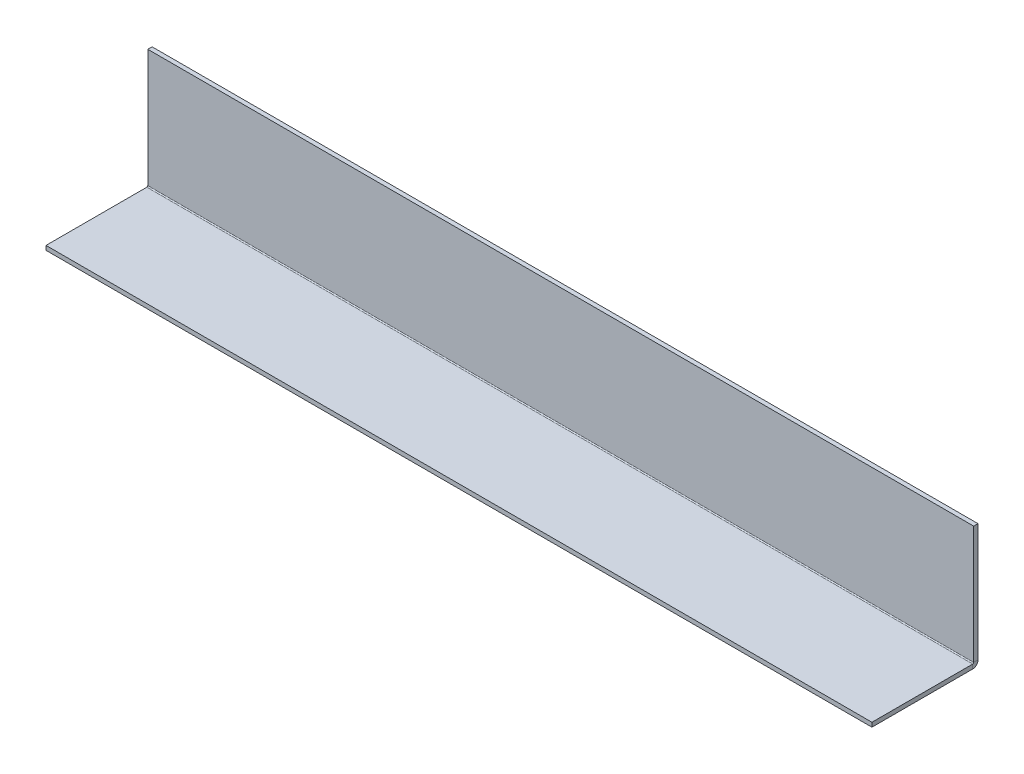
ISO-10303-21;
HEADER;
FILE_DESCRIPTION(('STEP AP214'),'2;1');
FILE_NAME('part.step','',(''),(''),'','','');
FILE_SCHEMA(('AUTOMOTIVE_DESIGN { 1 0 10303 214 1 1 1 1 }'));
ENDSEC;
DATA;
#1=APPLICATION_CONTEXT('core data for automotive mechanical design processes');
#2=APPLICATION_PROTOCOL_DEFINITION('international standard','automotive_design',2000,#1);
#3=PRODUCT_CONTEXT('',#1,'mechanical');
#4=PRODUCT('Part','Part','',(#3));
#5=PRODUCT_RELATED_PRODUCT_CATEGORY('part','',(#4));
#6=PRODUCT_DEFINITION_FORMATION('','',#4);
#7=PRODUCT_DEFINITION_CONTEXT('part definition',#1,'design');
#8=PRODUCT_DEFINITION('design','',#6,#7);
#9=PRODUCT_DEFINITION_SHAPE('','',#8);
#10=(LENGTH_UNIT() NAMED_UNIT(*) SI_UNIT(.MILLI.,.METRE.));
#11=(NAMED_UNIT(*) PLANE_ANGLE_UNIT() SI_UNIT($,.RADIAN.));
#12=(NAMED_UNIT(*) SI_UNIT($,.STERADIAN.) SOLID_ANGLE_UNIT());
#13=UNCERTAINTY_MEASURE_WITH_UNIT(LENGTH_MEASURE(1.E-05),#10,'distance_accuracy_value','');
#14=(GEOMETRIC_REPRESENTATION_CONTEXT(3) GLOBAL_UNCERTAINTY_ASSIGNED_CONTEXT((#13)) GLOBAL_UNIT_ASSIGNED_CONTEXT((#10,
#11,#12)) REPRESENTATION_CONTEXT('',''));
#15=CARTESIAN_POINT('',(0.,0.,0.));
#16=DIRECTION('',(0.,0.,1.));
#17=DIRECTION('',(1.,0.,0.));
#18=AXIS2_PLACEMENT_3D('',#15,#16,#17);
#19=CARTESIAN_POINT('',(304.8,-11.6112561284477,75.111256128448));
#20=DIRECTION('',(1.,0.,0.));
#21=DIRECTION('',(0.,-1.,0.));
#22=AXIS2_PLACEMENT_3D('',#19,#20,#21);
#23=PLANE('',#22);
#24=DIRECTION('',(0.,0.,-1.));
#25=VECTOR('',#24,1.);
#26=CARTESIAN_POINT('',(304.8,-11.6112561284477,75.111256128448));
#27=LINE('',#26,#25);
#28=CARTESIAN_POINT('',(304.8,-11.6112561284477,75.111256128448));
#29=VERTEX_POINT('',#28);
#30=CARTESIAN_POINT('',(304.8,-11.611256128448,0.736600000000014));
#31=VERTEX_POINT('',#30);
#32=EDGE_CURVE('E152',#29,#31,#27,.T.);
#33=ORIENTED_EDGE('',*,*,#32,.T.);
#34=DIRECTION('',(0.,1.,0.));
#35=VECTOR('',#34,1.);
#36=CARTESIAN_POINT('',(304.8,-11.6112561284474,0.7366));
#37=LINE('',#36,#35);
#38=CARTESIAN_POINT('',(304.8,-8.43625612844795,0.736600000000005));
#39=VERTEX_POINT('',#38);
#40=EDGE_CURVE('E48',#31,#39,#37,.T.);
#41=ORIENTED_EDGE('',*,*,#40,.T.);
#42=DIRECTION('',(0.,0.,-1.));
#43=VECTOR('',#42,1.);
#44=CARTESIAN_POINT('',(304.8,-8.43625612844771,75.111256128448));
#45=LINE('',#44,#43);
#46=CARTESIAN_POINT('',(304.8,-8.43625612844771,75.111256128448));
#47=VERTEX_POINT('',#46);
#48=EDGE_CURVE('E121',#47,#39,#45,.T.);
#49=ORIENTED_EDGE('',*,*,#48,.F.);
#50=DIRECTION('',(0.,1.,0.));
#51=VECTOR('',#50,1.);
#52=CARTESIAN_POINT('',(304.8,-11.6112561284477,75.111256128448));
#53=LINE('',#52,#51);
#54=EDGE_CURVE('E153',#29,#47,#53,.T.);
#55=ORIENTED_EDGE('',*,*,#54,.F.);
#56=EDGE_LOOP('',(#33,#41,#49,#55));
#57=FACE_BOUND('',#56,.T.);
#58=ADVANCED_FACE('F41',(#57),#23,.T.);
#59=CARTESIAN_POINT('',(-304.8,-11.6112561284477,75.111256128448));
#60=DIRECTION('',(-1.,0.,0.));
#61=DIRECTION('',(0.,1.,0.));
#62=AXIS2_PLACEMENT_3D('',#59,#60,#61);
#63=PLANE('',#62);
#64=DIRECTION('',(0.,0.,1.));
#65=VECTOR('',#64,1.);
#66=CARTESIAN_POINT('',(-304.8,-8.43625612844771,75.111256128448));
#67=LINE('',#66,#65);
#68=CARTESIAN_POINT('',(-304.8,-8.43625612844795,0.736600000000005));
#69=VERTEX_POINT('',#68);
#70=CARTESIAN_POINT('',(-304.8,-8.43625612844771,75.111256128448));
#71=VERTEX_POINT('',#70);
#72=EDGE_CURVE('E125',#69,#71,#67,.T.);
#73=ORIENTED_EDGE('',*,*,#72,.F.);
#74=DIRECTION('',(0.,-1.,0.));
#75=VECTOR('',#74,1.);
#76=CARTESIAN_POINT('',(-304.8,-11.6112561284474,0.7366));
#77=LINE('',#76,#75);
#78=CARTESIAN_POINT('',(-304.8,-11.611256128448,0.736600000000029));
#79=VERTEX_POINT('',#78);
#80=EDGE_CURVE('E160',#69,#79,#77,.T.);
#81=ORIENTED_EDGE('',*,*,#80,.T.);
#82=DIRECTION('',(0.,0.,1.));
#83=VECTOR('',#82,1.);
#84=CARTESIAN_POINT('',(-304.8,-11.6112561284477,75.111256128448));
#85=LINE('',#84,#83);
#86=CARTESIAN_POINT('',(-304.8,-11.6112561284477,75.111256128448));
#87=VERTEX_POINT('',#86);
#88=EDGE_CURVE('E148',#79,#87,#85,.T.);
#89=ORIENTED_EDGE('',*,*,#88,.T.);
#90=DIRECTION('',(0.,1.,0.));
#91=VECTOR('',#90,1.);
#92=CARTESIAN_POINT('',(-304.8,-11.6112561284477,75.111256128448));
#93=LINE('',#92,#91);
#94=EDGE_CURVE('E147',#87,#71,#93,.T.);
#95=ORIENTED_EDGE('',*,*,#94,.T.);
#96=EDGE_LOOP('',(#73,#81,#89,#95));
#97=FACE_BOUND('',#96,.T.);
#98=ADVANCED_FACE('F173',(#97),#63,.T.);
#99=CARTESIAN_POINT('',(0.,-11.611256128448,-10.613743871552));
#100=DIRECTION('',(0.,-1.,0.));
#101=DIRECTION('',(-1.,0.,0.));
#102=AXIS2_PLACEMENT_3D('',#99,#100,#101);
#103=PLANE('',#102);
#104=ORIENTED_EDGE('',*,*,#88,.F.);
#105=DIRECTION('',(1.,0.,0.));
#106=VECTOR('',#105,1.);
#107=CARTESIAN_POINT('',(0.,-11.611256128448,0.7366));
#108=LINE('',#107,#106);
#109=EDGE_CURVE('E155',#79,#31,#108,.T.);
#110=ORIENTED_EDGE('',*,*,#109,.T.);
#111=ORIENTED_EDGE('',*,*,#32,.F.);
#112=DIRECTION('',(1.,0.,0.));
#113=VECTOR('',#112,1.);
#114=CARTESIAN_POINT('',(-304.8,-11.6112561284477,75.111256128448));
#115=LINE('',#114,#113);
#116=EDGE_CURVE('E144',#87,#29,#115,.T.);
#117=ORIENTED_EDGE('',*,*,#116,.F.);
#118=EDGE_LOOP('',(#104,#110,#111,#117));
#119=FACE_BOUND('',#118,.T.);
#120=ADVANCED_FACE('F180',(#119),#103,.T.);
#121=CARTESIAN_POINT('',(-304.8,-11.6112561284477,75.111256128448));
#122=DIRECTION('',(0.,0.,1.));
#123=DIRECTION('',(0.,-1.,0.));
#124=AXIS2_PLACEMENT_3D('',#121,#122,#123);
#125=PLANE('',#124);
#126=DIRECTION('',(1.,0.,0.));
#127=VECTOR('',#126,1.);
#128=CARTESIAN_POINT('',(-304.8,-8.43625612844771,75.111256128448));
#129=LINE('',#128,#127);
#130=EDGE_CURVE('E149',#71,#47,#129,.T.);
#131=ORIENTED_EDGE('',*,*,#130,.F.);
#132=ORIENTED_EDGE('',*,*,#94,.F.);
#133=ORIENTED_EDGE('',*,*,#116,.T.);
#134=ORIENTED_EDGE('',*,*,#54,.T.);
#135=EDGE_LOOP('',(#131,#132,#133,#134));
#136=FACE_BOUND('',#135,.T.);
#137=ADVANCED_FACE('F178',(#136),#125,.T.);
#138=CARTESIAN_POINT('',(0.,-8.43625612844801,-10.613743871552));
#139=DIRECTION('',(0.,-1.,0.));
#140=DIRECTION('',(-1.,0.,0.));
#141=AXIS2_PLACEMENT_3D('',#138,#139,#140);
#142=PLANE('',#141);
#143=DIRECTION('',(1.,0.,0.));
#144=VECTOR('',#143,1.);
#145=CARTESIAN_POINT('',(0.,-8.43625612844797,0.736600000000013));
#146=LINE('',#145,#144);
#147=EDGE_CURVE('E163',#69,#39,#146,.T.);
#148=ORIENTED_EDGE('',*,*,#147,.F.);
#149=ORIENTED_EDGE('',*,*,#72,.T.);
#150=ORIENTED_EDGE('',*,*,#130,.T.);
#151=ORIENTED_EDGE('',*,*,#48,.T.);
#152=EDGE_LOOP('',(#148,#149,#150,#151));
#153=FACE_BOUND('',#152,.T.);
#154=ADVANCED_FACE('F185',(#153),#142,.F.);
#155=CARTESIAN_POINT('',(0.,0.,-3.175));
#156=DIRECTION('',(0.,0.,-1.));
#157=DIRECTION('',(-1.,0.,0.));
#158=AXIS2_PLACEMENT_3D('',#155,#156,#157);
#159=PLANE('',#158);
#160=DIRECTION('',(-1.,0.,0.));
#161=VECTOR('',#160,1.);
#162=CARTESIAN_POINT('',(304.8,79.375,-3.175));
#163=LINE('',#162,#161);
#164=CARTESIAN_POINT('',(304.8,79.375,-3.175));
#165=VERTEX_POINT('',#164);
#166=CARTESIAN_POINT('',(-304.8,79.375,-3.175));
#167=VERTEX_POINT('',#166);
#168=EDGE_CURVE('E104',#165,#167,#163,.T.);
#169=ORIENTED_EDGE('',*,*,#168,.F.);
#170=DIRECTION('',(0.,1.,0.));
#171=VECTOR('',#170,1.);
#172=CARTESIAN_POINT('',(304.8,-85.725,-3.175));
#173=LINE('',#172,#171);
#174=CARTESIAN_POINT('',(304.8,-7.69965612844796,-3.175));
#175=VERTEX_POINT('',#174);
#176=EDGE_CURVE('E113',#175,#165,#173,.T.);
#177=ORIENTED_EDGE('',*,*,#176,.F.);
#178=DIRECTION('',(1.,0.,0.));
#179=VECTOR('',#178,1.);
#180=CARTESIAN_POINT('',(0.,-7.69965612844796,-3.175));
#181=LINE('',#180,#179);
#182=CARTESIAN_POINT('',(-304.8,-7.69965612844796,-3.175));
#183=VERTEX_POINT('',#182);
#184=EDGE_CURVE('E142',#183,#175,#181,.T.);
#185=ORIENTED_EDGE('',*,*,#184,.F.);
#186=DIRECTION('',(0.,-1.,0.));
#187=VECTOR('',#186,1.);
#188=CARTESIAN_POINT('',(-304.8,-85.725,-3.175));
#189=LINE('',#188,#187);
#190=EDGE_CURVE('E115',#167,#183,#189,.T.);
#191=ORIENTED_EDGE('',*,*,#190,.F.);
#192=EDGE_LOOP('',(#169,#177,#185,#191));
#193=FACE_BOUND('',#192,.T.);
#194=ADVANCED_FACE('F111',(#193),#159,.T.);
#195=CARTESIAN_POINT('',(-304.8,-85.725,-3.175));
#196=DIRECTION('',(-1.,0.,0.));
#197=DIRECTION('',(0.,0.,1.));
#198=AXIS2_PLACEMENT_3D('',#195,#196,#197);
#199=PLANE('',#198);
#200=DIRECTION('',(0.,0.,-1.));
#201=VECTOR('',#200,1.);
#202=CARTESIAN_POINT('',(-304.8,79.375,75.111256128448));
#203=LINE('',#202,#201);
#204=CARTESIAN_POINT('',(-304.8,79.375,0.));
#205=VERTEX_POINT('',#204);
#206=EDGE_CURVE('E116',#205,#167,#203,.T.);
#207=ORIENTED_EDGE('',*,*,#206,.T.);
#208=ORIENTED_EDGE('',*,*,#190,.T.);
#209=DIRECTION('',(0.,0.,-1.));
#210=VECTOR('',#209,1.);
#211=CARTESIAN_POINT('',(-304.8,-7.69965612844795,-3.17499999999946));
#212=LINE('',#211,#210);
#213=CARTESIAN_POINT('',(-304.8,-7.69965612844797,0.));
#214=VERTEX_POINT('',#213);
#215=EDGE_CURVE('E138',#214,#183,#212,.T.);
#216=ORIENTED_EDGE('',*,*,#215,.F.);
#217=DIRECTION('',(0.,-1.,0.));
#218=VECTOR('',#217,1.);
#219=CARTESIAN_POINT('',(-304.8,-85.725,0.));
#220=LINE('',#219,#218);
#221=EDGE_CURVE('E135',#205,#214,#220,.T.);
#222=ORIENTED_EDGE('',*,*,#221,.F.);
#223=EDGE_LOOP('',(#207,#208,#216,#222));
#224=FACE_BOUND('',#223,.T.);
#225=ADVANCED_FACE('F205',(#224),#199,.T.);
#226=CARTESIAN_POINT('',(0.,0.,0.));
#227=DIRECTION('',(0.,0.,-1.));
#228=DIRECTION('',(-1.,0.,0.));
#229=AXIS2_PLACEMENT_3D('',#226,#227,#228);
#230=PLANE('',#229);
#231=DIRECTION('',(0.,1.,0.));
#232=VECTOR('',#231,1.);
#233=CARTESIAN_POINT('',(304.8,-85.725,0.));
#234=LINE('',#233,#232);
#235=CARTESIAN_POINT('',(304.8,-7.69965612844797,0.));
#236=VERTEX_POINT('',#235);
#237=CARTESIAN_POINT('',(304.8,79.375,0.));
#238=VERTEX_POINT('',#237);
#239=EDGE_CURVE('E122',#236,#238,#234,.T.);
#240=ORIENTED_EDGE('',*,*,#239,.T.);
#241=DIRECTION('',(-1.,0.,0.));
#242=VECTOR('',#241,1.);
#243=CARTESIAN_POINT('',(0.,79.375,0.));
#244=LINE('',#243,#242);
#245=EDGE_CURVE('E54',#238,#205,#244,.T.);
#246=ORIENTED_EDGE('',*,*,#245,.T.);
#247=ORIENTED_EDGE('',*,*,#221,.T.);
#248=DIRECTION('',(1.,0.,0.));
#249=VECTOR('',#248,1.);
#250=CARTESIAN_POINT('',(0.,-7.69965612844798,0.));
#251=LINE('',#250,#249);
#252=EDGE_CURVE('E127',#214,#236,#251,.T.);
#253=ORIENTED_EDGE('',*,*,#252,.T.);
#254=EDGE_LOOP('',(#240,#246,#247,#253));
#255=FACE_BOUND('',#254,.T.);
#256=ADVANCED_FACE('F208',(#255),#230,.F.);
#257=CARTESIAN_POINT('',(304.8,-85.725,-3.175));
#258=DIRECTION('',(1.,0.,0.));
#259=DIRECTION('',(0.,0.,-1.));
#260=AXIS2_PLACEMENT_3D('',#257,#258,#259);
#261=PLANE('',#260);
#262=DIRECTION('',(0.,0.,-1.));
#263=VECTOR('',#262,1.);
#264=CARTESIAN_POINT('',(304.8,79.375,-3.175));
#265=LINE('',#264,#263);
#266=EDGE_CURVE('E12',#238,#165,#265,.T.);
#267=ORIENTED_EDGE('',*,*,#266,.F.);
#268=ORIENTED_EDGE('',*,*,#239,.F.);
#269=DIRECTION('',(0.,0.,1.));
#270=VECTOR('',#269,1.);
#271=CARTESIAN_POINT('',(304.8,-7.69965612844795,-3.17499999999946));
#272=LINE('',#271,#270);
#273=EDGE_CURVE('E120',#175,#236,#272,.T.);
#274=ORIENTED_EDGE('',*,*,#273,.F.);
#275=ORIENTED_EDGE('',*,*,#176,.T.);
#276=EDGE_LOOP('',(#267,#268,#274,#275));
#277=FACE_BOUND('',#276,.T.);
#278=ADVANCED_FACE('F118',(#277),#261,.T.);
#279=CARTESIAN_POINT('',(-304.8,-7.69965612844796,0.7366));
#280=DIRECTION('',(-1.,0.,0.));
#281=DIRECTION('',(0.,0.,1.));
#282=AXIS2_PLACEMENT_3D('',#279,#280,#281);
#283=PLANE('',#282);
#284=ORIENTED_EDGE('',*,*,#80,.F.);
#285=CARTESIAN_POINT('',(-304.8,-7.69965612844796,0.7366));
#286=DIRECTION('',(-1.,0.,0.));
#287=DIRECTION('',(0.,0.,1.));
#288=AXIS2_PLACEMENT_3D('',#285,#286,#287);
#289=CIRCLE('',#288,0.7366);
#290=EDGE_CURVE('E193',#69,#214,#289,.F.);
#291=ORIENTED_EDGE('',*,*,#290,.T.);
#292=ORIENTED_EDGE('',*,*,#215,.T.);
#293=CARTESIAN_POINT('',(-304.8,-7.69965612844796,0.7366));
#294=DIRECTION('',(1.,0.,0.));
#295=DIRECTION('',(0.,0.,1.));
#296=AXIS2_PLACEMENT_3D('',#293,#294,#295);
#297=CIRCLE('',#296,3.9116);
#298=EDGE_CURVE('E196',#79,#183,#297,.T.);
#299=ORIENTED_EDGE('',*,*,#298,.F.);
#300=EDGE_LOOP('',(#284,#291,#292,#299));
#301=FACE_BOUND('',#300,.T.);
#302=ADVANCED_FACE('F210',(#301),#283,.T.);
#303=CARTESIAN_POINT('',(304.8,-7.69965612844796,0.7366));
#304=DIRECTION('',(1.,0.,0.));
#305=DIRECTION('',(0.,0.,-1.));
#306=AXIS2_PLACEMENT_3D('',#303,#304,#305);
#307=PLANE('',#306);
#308=CARTESIAN_POINT('',(304.8,-7.69965612844796,0.7366));
#309=DIRECTION('',(-1.,0.,0.));
#310=DIRECTION('',(0.,0.,1.));
#311=AXIS2_PLACEMENT_3D('',#308,#309,#310);
#312=CIRCLE('',#311,0.7366);
#313=EDGE_CURVE('E130',#236,#39,#312,.T.);
#314=ORIENTED_EDGE('',*,*,#313,.T.);
#315=ORIENTED_EDGE('',*,*,#40,.F.);
#316=CARTESIAN_POINT('',(304.8,-7.69965612844796,0.7366));
#317=DIRECTION('',(-1.,0.,0.));
#318=DIRECTION('',(0.,0.,-1.));
#319=AXIS2_PLACEMENT_3D('',#316,#317,#318);
#320=CIRCLE('',#319,3.9116);
#321=EDGE_CURVE('E62',#175,#31,#320,.T.);
#322=ORIENTED_EDGE('',*,*,#321,.F.);
#323=ORIENTED_EDGE('',*,*,#273,.T.);
#324=EDGE_LOOP('',(#314,#315,#322,#323));
#325=FACE_BOUND('',#324,.T.);
#326=ADVANCED_FACE('F195',(#325),#307,.T.);
#327=CARTESIAN_POINT('',(609.619199292474,-7.69965612844796,0.7366));
#328=DIRECTION('',(-1.,0.,0.));
#329=DIRECTION('',(0.,0.,1.));
#330=AXIS2_PLACEMENT_3D('',#327,#328,#329);
#331=CYLINDRICAL_SURFACE('',#330,3.9116);
#332=ORIENTED_EDGE('',*,*,#184,.T.);
#333=ORIENTED_EDGE('',*,*,#321,.T.);
#334=ORIENTED_EDGE('',*,*,#109,.F.);
#335=ORIENTED_EDGE('',*,*,#298,.T.);
#336=EDGE_LOOP('',(#332,#333,#334,#335));
#337=FACE_BOUND('',#336,.T.);
#338=ADVANCED_FACE('F211',(#337),#331,.T.);
#339=CARTESIAN_POINT('',(609.619199292474,-7.69965612844796,0.7366));
#340=DIRECTION('',(-1.,0.,0.));
#341=DIRECTION('',(0.,0.,1.));
#342=AXIS2_PLACEMENT_3D('',#339,#340,#341);
#343=CYLINDRICAL_SURFACE('',#342,0.7366);
#344=ORIENTED_EDGE('',*,*,#252,.F.);
#345=ORIENTED_EDGE('',*,*,#290,.F.);
#346=ORIENTED_EDGE('',*,*,#147,.T.);
#347=ORIENTED_EDGE('',*,*,#313,.F.);
#348=EDGE_LOOP('',(#344,#345,#346,#347));
#349=FACE_BOUND('',#348,.T.);
#350=ADVANCED_FACE('F191',(#349),#343,.F.);
#351=CARTESIAN_POINT('',(304.8,79.375,75.111256128448));
#352=DIRECTION('',(0.,-1.,0.));
#353=DIRECTION('',(0.,0.,-1.));
#354=AXIS2_PLACEMENT_3D('',#351,#352,#353);
#355=PLANE('',#354);
#356=ORIENTED_EDGE('',*,*,#266,.T.);
#357=ORIENTED_EDGE('',*,*,#168,.T.);
#358=ORIENTED_EDGE('',*,*,#206,.F.);
#359=ORIENTED_EDGE('',*,*,#245,.F.);
#360=EDGE_LOOP('',(#356,#357,#358,#359));
#361=FACE_BOUND('',#360,.T.);
#362=ADVANCED_FACE('F103',(#361),#355,.F.);
#363=CLOSED_SHELL('',(#58,#98,#120,#137,#154,#194,#225,#256,#278,#302,#326,#338,#350,#362));
#364=MANIFOLD_SOLID_BREP('B2',#363);
#365=ADVANCED_BREP_SHAPE_REPRESENTATION('',(#18,#364),#14);
#366=SHAPE_DEFINITION_REPRESENTATION(#9,#365);
ENDSEC;
END-ISO-10303-21;
